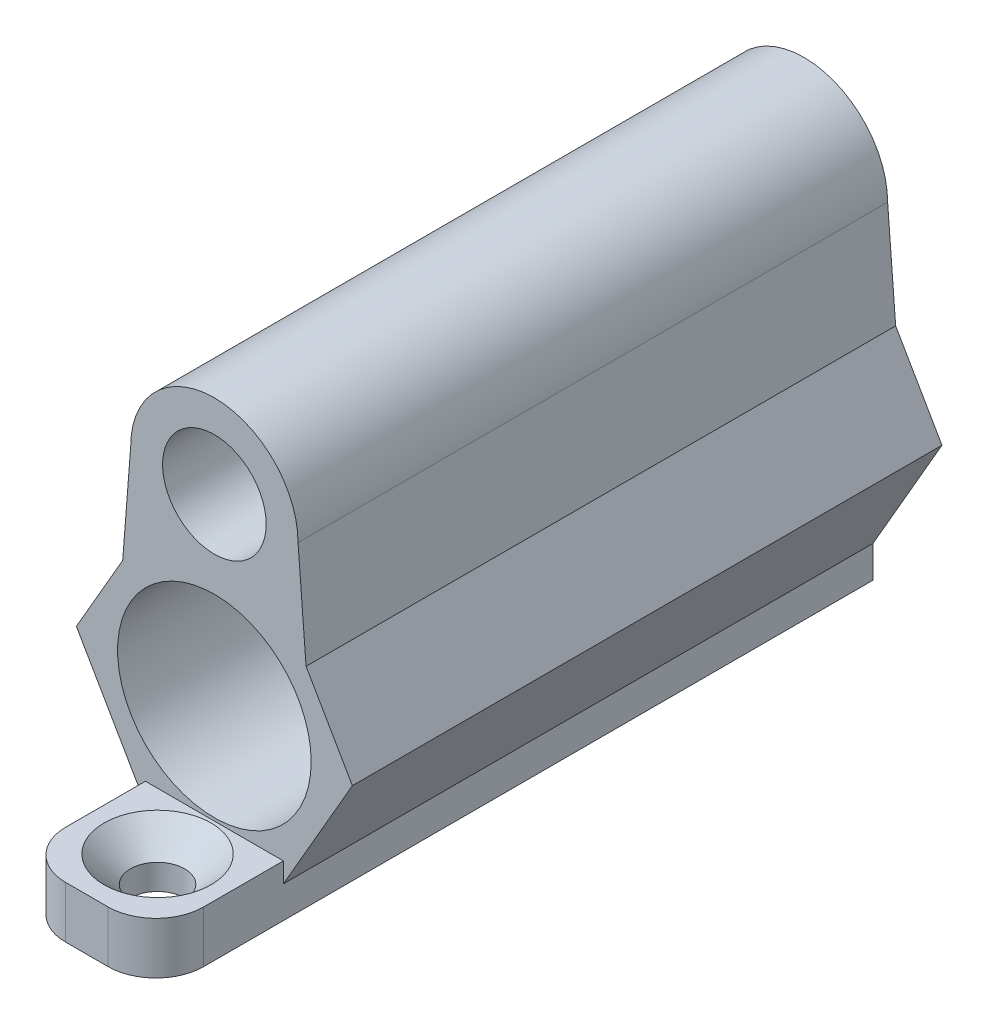
ISO-10303-21;
HEADER;
FILE_DESCRIPTION(('STEP AP214'),'2;1');
FILE_NAME('part.step','',(''),(''),'','','');
FILE_SCHEMA(('AUTOMOTIVE_DESIGN { 1 0 10303 214 1 1 1 1 }'));
ENDSEC;
DATA;
#1=APPLICATION_CONTEXT('core data for automotive mechanical design processes');
#2=APPLICATION_PROTOCOL_DEFINITION('international standard','automotive_design',2000,#1);
#3=PRODUCT_CONTEXT('',#1,'mechanical');
#4=PRODUCT('Part','Part','',(#3));
#5=PRODUCT_RELATED_PRODUCT_CATEGORY('part','',(#4));
#6=PRODUCT_DEFINITION_FORMATION('','',#4);
#7=PRODUCT_DEFINITION_CONTEXT('part definition',#1,'design');
#8=PRODUCT_DEFINITION('design','',#6,#7);
#9=PRODUCT_DEFINITION_SHAPE('','',#8);
#10=(LENGTH_UNIT() NAMED_UNIT(*) SI_UNIT(.MILLI.,.METRE.));
#11=(NAMED_UNIT(*) PLANE_ANGLE_UNIT() SI_UNIT($,.RADIAN.));
#12=(NAMED_UNIT(*) SI_UNIT($,.STERADIAN.) SOLID_ANGLE_UNIT());
#13=UNCERTAINTY_MEASURE_WITH_UNIT(LENGTH_MEASURE(1.E-05),#10,'distance_accuracy_value','');
#14=(GEOMETRIC_REPRESENTATION_CONTEXT(3) GLOBAL_UNCERTAINTY_ASSIGNED_CONTEXT((#13)) GLOBAL_UNIT_ASSIGNED_CONTEXT((#10,
#11,#12)) REPRESENTATION_CONTEXT('',''));
#15=CARTESIAN_POINT('',(0.,0.,0.));
#16=DIRECTION('',(0.,0.,1.));
#17=DIRECTION('',(1.,0.,0.));
#18=AXIS2_PLACEMENT_3D('',#15,#16,#17);
#19=CARTESIAN_POINT('',(3.24759526419165,1.875,37.));
#20=DIRECTION('',(-0.866025403784438,-0.5,0.));
#21=DIRECTION('',(0.5,-0.866025403784439,0.));
#22=AXIS2_PLACEMENT_3D('',#19,#20,#21);
#23=PLANE('',#22);
#24=DIRECTION('',(0.,0.,1.));
#25=VECTOR('',#24,1.);
#26=CARTESIAN_POINT('',(5.75349685702698,-2.46534887755855,0.));
#27=LINE('',#26,#25);
#28=CARTESIAN_POINT('',(5.75349685702698,-2.46534887755856,0.));
#29=VERTEX_POINT('',#28);
#30=CARTESIAN_POINT('',(5.75349685702698,-2.46534887755856,37.));
#31=VERTEX_POINT('',#30);
#32=EDGE_CURVE('E316',#29,#31,#27,.T.);
#33=ORIENTED_EDGE('',*,*,#32,.T.);
#34=DIRECTION('',(-0.5,0.866025403784439,0.));
#35=VECTOR('',#34,1.);
#36=CARTESIAN_POINT('',(3.24759526419165,1.875,37.));
#37=LINE('',#36,#35);
#38=CARTESIAN_POINT('',(8.66025403784439,-7.49999999999999,37.));
#39=VERTEX_POINT('',#38);
#40=EDGE_CURVE('E175',#39,#31,#37,.T.);
#41=ORIENTED_EDGE('',*,*,#40,.F.);
#42=DIRECTION('',(0.,0.,-1.));
#43=VECTOR('',#42,1.);
#44=CARTESIAN_POINT('',(8.66025403784439,-7.49999999999999,37.));
#45=LINE('',#44,#43);
#46=CARTESIAN_POINT('',(8.66025403784439,-7.49999999999999,0.));
#47=VERTEX_POINT('',#46);
#48=EDGE_CURVE('E167',#39,#47,#45,.T.);
#49=ORIENTED_EDGE('',*,*,#48,.T.);
#50=DIRECTION('',(-0.5,0.866025403784439,0.));
#51=VECTOR('',#50,1.);
#52=CARTESIAN_POINT('',(3.24759526419165,1.875,0.));
#53=LINE('',#52,#51);
#54=EDGE_CURVE('E251',#47,#29,#53,.T.);
#55=ORIENTED_EDGE('',*,*,#54,.T.);
#56=EDGE_LOOP('',(#33,#41,#49,#55));
#57=FACE_BOUND('',#56,.T.);
#58=ADVANCED_FACE('F35',(#57),#23,.F.);
#59=CARTESIAN_POINT('',(0.,-7.5,37.));
#60=DIRECTION('',(0.,0.,-1.));
#61=DIRECTION('',(-1.,0.,0.));
#62=AXIS2_PLACEMENT_3D('',#59,#60,#61);
#63=CYLINDRICAL_SURFACE('',#62,2.44);
#64=CARTESIAN_POINT('',(0.,-7.5,0.));
#65=DIRECTION('',(0.,0.,1.));
#66=DIRECTION('',(1.,0.,0.));
#67=AXIS2_PLACEMENT_3D('',#64,#65,#66);
#68=CIRCLE('',#67,2.44);
#69=CARTESIAN_POINT('',(2.44000000000001,-7.5,0.));
#70=VERTEX_POINT('',#69);
#71=EDGE_CURVE('E252',#70,#70,#68,.T.);
#72=ORIENTED_EDGE('',*,*,#71,.F.);
#73=EDGE_LOOP('',(#72));
#74=FACE_BOUND('',#73,.T.);
#75=CARTESIAN_POINT('',(0.,-7.5,4.));
#76=DIRECTION('',(0.,0.,1.));
#77=DIRECTION('',(1.,0.,0.));
#78=AXIS2_PLACEMENT_3D('',#75,#76,#77);
#79=CIRCLE('',#78,2.44);
#80=CARTESIAN_POINT('',(2.44000000000001,-7.5,4.));
#81=VERTEX_POINT('',#80);
#82=EDGE_CURVE('E278',#81,#81,#79,.T.);
#83=ORIENTED_EDGE('',*,*,#82,.T.);
#84=EDGE_LOOP('',(#83));
#85=FACE_BOUND('',#84,.T.);
#86=ADVANCED_FACE('F221',(#74,#85),#63,.F.);
#87=CARTESIAN_POINT('',(0.,4.,37.));
#88=DIRECTION('',(0.,0.,-1.));
#89=DIRECTION('',(-1.,0.,0.));
#90=AXIS2_PLACEMENT_3D('',#87,#88,#89);
#91=CYLINDRICAL_SURFACE('',#90,2.44);
#92=CARTESIAN_POINT('',(0.,4.,0.));
#93=DIRECTION('',(0.,0.,1.));
#94=DIRECTION('',(1.,0.,0.));
#95=AXIS2_PLACEMENT_3D('',#92,#93,#94);
#96=CIRCLE('',#95,2.44);
#97=CARTESIAN_POINT('',(2.44,4.,0.));
#98=VERTEX_POINT('',#97);
#99=EDGE_CURVE('E176',#98,#98,#96,.T.);
#100=ORIENTED_EDGE('',*,*,#99,.F.);
#101=EDGE_LOOP('',(#100));
#102=FACE_BOUND('',#101,.T.);
#103=CARTESIAN_POINT('',(0.,4.,4.));
#104=DIRECTION('',(0.,0.,1.));
#105=DIRECTION('',(1.,0.,0.));
#106=AXIS2_PLACEMENT_3D('',#103,#104,#105);
#107=CIRCLE('',#106,2.44);
#108=CARTESIAN_POINT('',(2.44,4.,4.));
#109=VERTEX_POINT('',#108);
#110=EDGE_CURVE('E274',#109,#109,#107,.T.);
#111=ORIENTED_EDGE('',*,*,#110,.T.);
#112=EDGE_LOOP('',(#111));
#113=FACE_BOUND('',#112,.T.);
#114=ADVANCED_FACE('F227',(#102,#113),#91,.F.);
#115=CARTESIAN_POINT('',(9.74278579257493,-5.62499999999999,37.));
#116=DIRECTION('',(-0.866025403784439,0.5,0.));
#117=DIRECTION('',(-0.5,-0.866025403784439,0.));
#118=AXIS2_PLACEMENT_3D('',#115,#116,#117);
#119=PLANE('',#118);
#120=DIRECTION('',(0.5,0.866025403784439,0.));
#121=VECTOR('',#120,1.);
#122=CARTESIAN_POINT('',(9.74278579257493,-5.62499999999999,0.));
#123=LINE('',#122,#121);
#124=CARTESIAN_POINT('',(4.33012701892219,-15.,0.));
#125=VERTEX_POINT('',#124);
#126=EDGE_CURVE('E245',#125,#47,#123,.T.);
#127=ORIENTED_EDGE('',*,*,#126,.T.);
#128=ORIENTED_EDGE('',*,*,#48,.F.);
#129=DIRECTION('',(0.5,0.866025403784439,0.));
#130=VECTOR('',#129,1.);
#131=CARTESIAN_POINT('',(9.74278579257493,-5.62499999999999,37.));
#132=LINE('',#131,#130);
#133=CARTESIAN_POINT('',(4.33012701892219,-15.,37.));
#134=VERTEX_POINT('',#133);
#135=EDGE_CURVE('E173',#134,#39,#132,.T.);
#136=ORIENTED_EDGE('',*,*,#135,.F.);
#137=DIRECTION('',(0.,0.,-1.));
#138=VECTOR('',#137,1.);
#139=CARTESIAN_POINT('',(4.33012701892219,-15.,37.));
#140=LINE('',#139,#138);
#141=EDGE_CURVE('E161',#134,#125,#140,.T.);
#142=ORIENTED_EDGE('',*,*,#141,.T.);
#143=EDGE_LOOP('',(#127,#128,#136,#142));
#144=FACE_BOUND('',#143,.T.);
#145=ADVANCED_FACE('F233',(#144),#119,.F.);
#146=CARTESIAN_POINT('',(-3.24759526419163,1.87499999999999,37.));
#147=DIRECTION('',(0.866025403784439,-0.5,0.));
#148=DIRECTION('',(0.5,0.866025403784439,0.));
#149=AXIS2_PLACEMENT_3D('',#146,#147,#148);
#150=PLANE('',#149);
#151=DIRECTION('',(-0.5,-0.866025403784439,0.));
#152=VECTOR('',#151,1.);
#153=CARTESIAN_POINT('',(-3.24759526419163,1.87499999999999,37.));
#154=LINE('',#153,#152);
#155=CARTESIAN_POINT('',(-5.75349685702695,-2.46534887755856,37.));
#156=VERTEX_POINT('',#155);
#157=CARTESIAN_POINT('',(-8.66025403784437,-7.50000000000001,37.));
#158=VERTEX_POINT('',#157);
#159=EDGE_CURVE('E184',#156,#158,#154,.T.);
#160=ORIENTED_EDGE('',*,*,#159,.F.);
#161=DIRECTION('',(0.,0.,1.));
#162=VECTOR('',#161,1.);
#163=CARTESIAN_POINT('',(-5.75349685702695,-2.46534887755856,0.));
#164=LINE('',#163,#162);
#165=CARTESIAN_POINT('',(-5.75349685702695,-2.46534887755856,0.));
#166=VERTEX_POINT('',#165);
#167=EDGE_CURVE('E318',#166,#156,#164,.T.);
#168=ORIENTED_EDGE('',*,*,#167,.F.);
#169=DIRECTION('',(-0.5,-0.866025403784439,0.));
#170=VECTOR('',#169,1.);
#171=CARTESIAN_POINT('',(-3.24759526419163,1.87499999999999,0.));
#172=LINE('',#171,#170);
#173=CARTESIAN_POINT('',(-8.66025403784437,-7.50000000000001,0.));
#174=VERTEX_POINT('',#173);
#175=EDGE_CURVE('E263',#166,#174,#172,.T.);
#176=ORIENTED_EDGE('',*,*,#175,.T.);
#177=DIRECTION('',(0.,0.,-1.));
#178=VECTOR('',#177,1.);
#179=CARTESIAN_POINT('',(-8.66025403784437,-7.50000000000001,37.));
#180=LINE('',#179,#178);
#181=EDGE_CURVE('E189',#158,#174,#180,.T.);
#182=ORIENTED_EDGE('',*,*,#181,.F.);
#183=EDGE_LOOP('',(#160,#168,#176,#182));
#184=FACE_BOUND('',#183,.T.);
#185=ADVANCED_FACE('F231',(#184),#150,.F.);
#186=CARTESIAN_POINT('',(-9.74278579257492,-5.625,37.));
#187=DIRECTION('',(0.866025403784438,0.500000000000001,0.));
#188=DIRECTION('',(-0.500000000000001,0.866025403784438,0.));
#189=AXIS2_PLACEMENT_3D('',#186,#187,#188);
#190=PLANE('',#189);
#191=DIRECTION('',(0.500000000000001,-0.866025403784438,0.));
#192=VECTOR('',#191,1.);
#193=CARTESIAN_POINT('',(-9.74278579257492,-5.625,0.));
#194=LINE('',#193,#192);
#195=CARTESIAN_POINT('',(-4.33012701892216,-15.,0.));
#196=VERTEX_POINT('',#195);
#197=EDGE_CURVE('E265',#174,#196,#194,.T.);
#198=ORIENTED_EDGE('',*,*,#197,.T.);
#199=DIRECTION('',(0.,0.,-1.));
#200=VECTOR('',#199,1.);
#201=CARTESIAN_POINT('',(-4.33012701892216,-15.,37.));
#202=LINE('',#201,#200);
#203=CARTESIAN_POINT('',(-4.33012701892216,-15.,37.));
#204=VERTEX_POINT('',#203);
#205=EDGE_CURVE('E183',#204,#196,#202,.T.);
#206=ORIENTED_EDGE('',*,*,#205,.F.);
#207=DIRECTION('',(0.500000000000001,-0.866025403784438,0.));
#208=VECTOR('',#207,1.);
#209=CARTESIAN_POINT('',(-9.74278579257492,-5.625,37.));
#210=LINE('',#209,#208);
#211=EDGE_CURVE('E181',#158,#204,#210,.T.);
#212=ORIENTED_EDGE('',*,*,#211,.F.);
#213=ORIENTED_EDGE('',*,*,#181,.T.);
#214=EDGE_LOOP('',(#198,#206,#212,#213));
#215=FACE_BOUND('',#214,.T.);
#216=ADVANCED_FACE('F240',(#215),#190,.F.);
#217=CARTESIAN_POINT('',(0.,0.,37.));
#218=DIRECTION('',(0.,0.,1.));
#219=DIRECTION('',(1.,0.,0.));
#220=AXIS2_PLACEMENT_3D('',#217,#218,#219);
#221=PLANE('',#220);
#222=DIRECTION('',(0.,-1.,0.));
#223=VECTOR('',#222,1.);
#224=CARTESIAN_POINT('',(-4.33012701892216,-13.754091294147,37.));
#225=LINE('',#224,#223);
#226=CARTESIAN_POINT('',(-4.33012701892216,-13.754091294147,37.));
#227=VERTEX_POINT('',#226);
#228=EDGE_CURVE('E154',#227,#204,#225,.T.);
#229=ORIENTED_EDGE('',*,*,#228,.F.);
#230=DIRECTION('',(-1.,0.,0.));
#231=VECTOR('',#230,1.);
#232=CARTESIAN_POINT('',(-4.33012701892216,-13.754091294147,37.));
#233=LINE('',#232,#231);
#234=CARTESIAN_POINT('',(4.33012701892219,-13.754091294147,37.));
#235=VERTEX_POINT('',#234);
#236=EDGE_CURVE('E141',#235,#227,#233,.T.);
#237=ORIENTED_EDGE('',*,*,#236,.F.);
#238=DIRECTION('',(0.,1.,0.));
#239=VECTOR('',#238,1.);
#240=CARTESIAN_POINT('',(4.33012701892219,-13.754091294147,37.));
#241=LINE('',#240,#239);
#242=EDGE_CURVE('E151',#134,#235,#241,.T.);
#243=ORIENTED_EDGE('',*,*,#242,.F.);
#244=ORIENTED_EDGE('',*,*,#135,.T.);
#245=ORIENTED_EDGE('',*,*,#40,.T.);
#246=DIRECTION('',(0.0776411291267554,-0.996981371474875,0.));
#247=VECTOR('',#246,1.);
#248=CARTESIAN_POINT('',(5.5279792767052,0.430498066576475,37.));
#249=LINE('',#248,#247);
#250=CARTESIAN_POINT('',(5.25,4.,37.));
#251=VERTEX_POINT('',#250);
#252=EDGE_CURVE('E301',#251,#31,#249,.T.);
#253=ORIENTED_EDGE('',*,*,#252,.F.);
#254=CARTESIAN_POINT('',(0.,4.,37.));
#255=DIRECTION('',(0.,0.,1.));
#256=DIRECTION('',(1.,0.,0.));
#257=AXIS2_PLACEMENT_3D('',#254,#255,#256);
#258=CIRCLE('',#257,5.25);
#259=CARTESIAN_POINT('',(-5.25,4.,37.));
#260=VERTEX_POINT('',#259);
#261=EDGE_CURVE('E296',#251,#260,#258,.T.);
#262=ORIENTED_EDGE('',*,*,#261,.T.);
#263=DIRECTION('',(-0.0776411291267501,-0.996981371474875,0.));
#264=VECTOR('',#263,1.);
#265=CARTESIAN_POINT('',(-5.52797927670518,0.430498066576444,37.));
#266=LINE('',#265,#264);
#267=EDGE_CURVE('E308',#260,#156,#266,.T.);
#268=ORIENTED_EDGE('',*,*,#267,.T.);
#269=ORIENTED_EDGE('',*,*,#159,.T.);
#270=ORIENTED_EDGE('',*,*,#211,.T.);
#271=EDGE_LOOP('',(#229,#237,#243,#244,#245,#253,#262,#268,#269,#270));
#272=FACE_BOUND('',#271,.T.);
#273=CARTESIAN_POINT('',(0.,-7.5,37.));
#274=DIRECTION('',(0.,0.,1.));
#275=DIRECTION('',(1.,0.,0.));
#276=AXIS2_PLACEMENT_3D('',#273,#274,#275);
#277=CIRCLE('',#276,6.075);
#278=CARTESIAN_POINT('',(6.07500000000001,-7.5,37.));
#279=VERTEX_POINT('',#278);
#280=EDGE_CURVE('E315',#279,#279,#277,.T.);
#281=ORIENTED_EDGE('',*,*,#280,.F.);
#282=EDGE_LOOP('',(#281));
#283=FACE_BOUND('',#282,.T.);
#284=CARTESIAN_POINT('',(0.,4.,37.));
#285=DIRECTION('',(0.,0.,1.));
#286=DIRECTION('',(1.,0.,0.));
#287=AXIS2_PLACEMENT_3D('',#284,#285,#286);
#288=CIRCLE('',#287,3.25);
#289=CARTESIAN_POINT('',(3.25,4.,37.));
#290=VERTEX_POINT('',#289);
#291=EDGE_CURVE('E280',#290,#290,#288,.T.);
#292=ORIENTED_EDGE('',*,*,#291,.F.);
#293=EDGE_LOOP('',(#292));
#294=FACE_BOUND('',#293,.T.);
#295=ADVANCED_FACE('F149',(#272,#283,#294),#221,.T.);
#296=CARTESIAN_POINT('',(0.,0.,0.));
#297=DIRECTION('',(0.,0.,1.));
#298=DIRECTION('',(1.,0.,0.));
#299=AXIS2_PLACEMENT_3D('',#296,#297,#298);
#300=PLANE('',#299);
#301=DIRECTION('',(0.0776411291267554,-0.996981371474875,0.));
#302=VECTOR('',#301,1.);
#303=CARTESIAN_POINT('',(5.5279792767052,0.430498066576475,0.));
#304=LINE('',#303,#302);
#305=CARTESIAN_POINT('',(5.25,4.,0.));
#306=VERTEX_POINT('',#305);
#307=EDGE_CURVE('E261',#306,#29,#304,.T.);
#308=ORIENTED_EDGE('',*,*,#307,.T.);
#309=ORIENTED_EDGE('',*,*,#54,.F.);
#310=ORIENTED_EDGE('',*,*,#126,.F.);
#311=DIRECTION('',(0.,1.,0.));
#312=VECTOR('',#311,1.);
#313=CARTESIAN_POINT('',(4.33012701892219,-17.,0.));
#314=LINE('',#313,#312);
#315=CARTESIAN_POINT('',(4.33012701892219,-17.,0.));
#316=VERTEX_POINT('',#315);
#317=EDGE_CURVE('E291',#316,#125,#314,.T.);
#318=ORIENTED_EDGE('',*,*,#317,.F.);
#319=DIRECTION('',(1.,0.,0.));
#320=VECTOR('',#319,1.);
#321=CARTESIAN_POINT('',(-4.33012701892216,-17.,0.));
#322=LINE('',#321,#320);
#323=CARTESIAN_POINT('',(-4.33012701892216,-17.,0.));
#324=VERTEX_POINT('',#323);
#325=EDGE_CURVE('E288',#324,#316,#322,.T.);
#326=ORIENTED_EDGE('',*,*,#325,.F.);
#327=DIRECTION('',(0.,1.,0.));
#328=VECTOR('',#327,1.);
#329=CARTESIAN_POINT('',(-4.33012701892216,-17.,0.));
#330=LINE('',#329,#328);
#331=EDGE_CURVE('E293',#324,#196,#330,.T.);
#332=ORIENTED_EDGE('',*,*,#331,.T.);
#333=ORIENTED_EDGE('',*,*,#197,.F.);
#334=ORIENTED_EDGE('',*,*,#175,.F.);
#335=DIRECTION('',(-0.0776411291267501,-0.996981371474875,0.));
#336=VECTOR('',#335,1.);
#337=CARTESIAN_POINT('',(-5.52797927670518,0.430498066576444,0.));
#338=LINE('',#337,#336);
#339=CARTESIAN_POINT('',(-5.25,4.,0.));
#340=VERTEX_POINT('',#339);
#341=EDGE_CURVE('E300',#340,#166,#338,.T.);
#342=ORIENTED_EDGE('',*,*,#341,.F.);
#343=CARTESIAN_POINT('',(0.,4.,0.));
#344=DIRECTION('',(0.,0.,1.));
#345=DIRECTION('',(1.,0.,0.));
#346=AXIS2_PLACEMENT_3D('',#343,#344,#345);
#347=CIRCLE('',#346,5.25);
#348=EDGE_CURVE('E297',#306,#340,#347,.T.);
#349=ORIENTED_EDGE('',*,*,#348,.F.);
#350=EDGE_LOOP('',(#308,#309,#310,#318,#326,#332,#333,#334,#342,#349));
#351=FACE_BOUND('',#350,.T.);
#352=ORIENTED_EDGE('',*,*,#71,.T.);
#353=EDGE_LOOP('',(#352));
#354=FACE_BOUND('',#353,.T.);
#355=ORIENTED_EDGE('',*,*,#99,.T.);
#356=EDGE_LOOP('',(#355));
#357=FACE_BOUND('',#356,.T.);
#358=ADVANCED_FACE('F257',(#351,#354,#357),#300,.F.);
#359=CARTESIAN_POINT('',(0.,4.,4.));
#360=DIRECTION('',(0.,0.,1.));
#361=DIRECTION('',(1.,0.,0.));
#362=AXIS2_PLACEMENT_3D('',#359,#360,#361);
#363=CYLINDRICAL_SURFACE('',#362,3.25);
#364=CARTESIAN_POINT('',(0.,4.,4.));
#365=DIRECTION('',(0.,0.,1.));
#366=DIRECTION('',(1.,0.,0.));
#367=AXIS2_PLACEMENT_3D('',#364,#365,#366);
#368=CIRCLE('',#367,3.25);
#369=CARTESIAN_POINT('',(3.25,4.,4.));
#370=VERTEX_POINT('',#369);
#371=EDGE_CURVE('E277',#370,#370,#368,.T.);
#372=ORIENTED_EDGE('',*,*,#371,.F.);
#373=EDGE_LOOP('',(#372));
#374=FACE_BOUND('',#373,.T.);
#375=ORIENTED_EDGE('',*,*,#291,.T.);
#376=EDGE_LOOP('',(#375));
#377=FACE_BOUND('',#376,.T.);
#378=ADVANCED_FACE('F355',(#374,#377),#363,.F.);
#379=CARTESIAN_POINT('',(0.,4.,4.));
#380=DIRECTION('',(0.,0.,1.));
#381=DIRECTION('',(1.,0.,0.));
#382=AXIS2_PLACEMENT_3D('',#379,#380,#381);
#383=PLANE('',#382);
#384=ORIENTED_EDGE('',*,*,#110,.F.);
#385=EDGE_LOOP('',(#384));
#386=FACE_BOUND('',#385,.T.);
#387=ORIENTED_EDGE('',*,*,#371,.T.);
#388=EDGE_LOOP('',(#387));
#389=FACE_BOUND('',#388,.T.);
#390=ADVANCED_FACE('F347',(#386,#389),#383,.T.);
#391=CARTESIAN_POINT('',(0.,-7.5,4.));
#392=DIRECTION('',(0.,0.,1.));
#393=DIRECTION('',(1.,0.,0.));
#394=AXIS2_PLACEMENT_3D('',#391,#392,#393);
#395=CYLINDRICAL_SURFACE('',#394,6.075);
#396=CARTESIAN_POINT('',(0.,-7.5,4.));
#397=DIRECTION('',(0.,0.,1.));
#398=DIRECTION('',(1.,0.,0.));
#399=AXIS2_PLACEMENT_3D('',#396,#397,#398);
#400=CIRCLE('',#399,6.075);
#401=CARTESIAN_POINT('',(6.07500000000001,-7.5,4.));
#402=VERTEX_POINT('',#401);
#403=EDGE_CURVE('E281',#402,#402,#400,.T.);
#404=ORIENTED_EDGE('',*,*,#403,.F.);
#405=EDGE_LOOP('',(#404));
#406=FACE_BOUND('',#405,.T.);
#407=ORIENTED_EDGE('',*,*,#280,.T.);
#408=EDGE_LOOP('',(#407));
#409=FACE_BOUND('',#408,.T.);
#410=ADVANCED_FACE('F341',(#406,#409),#395,.F.);
#411=CARTESIAN_POINT('',(0.,-7.5,4.));
#412=DIRECTION('',(0.,0.,1.));
#413=DIRECTION('',(1.,0.,0.));
#414=AXIS2_PLACEMENT_3D('',#411,#412,#413);
#415=PLANE('',#414);
#416=ORIENTED_EDGE('',*,*,#82,.F.);
#417=EDGE_LOOP('',(#416));
#418=FACE_BOUND('',#417,.T.);
#419=ORIENTED_EDGE('',*,*,#403,.T.);
#420=EDGE_LOOP('',(#419));
#421=FACE_BOUND('',#420,.T.);
#422=ADVANCED_FACE('F337',(#418,#421),#415,.T.);
#423=CARTESIAN_POINT('',(0.,4.,0.));
#424=DIRECTION('',(0.,0.,1.));
#425=DIRECTION('',(1.,0.,0.));
#426=AXIS2_PLACEMENT_3D('',#423,#424,#425);
#427=CYLINDRICAL_SURFACE('',#426,5.25);
#428=ORIENTED_EDGE('',*,*,#261,.F.);
#429=DIRECTION('',(0.,0.,1.));
#430=VECTOR('',#429,1.);
#431=CARTESIAN_POINT('',(5.25,4.,0.));
#432=LINE('',#431,#430);
#433=EDGE_CURVE('E313',#306,#251,#432,.T.);
#434=ORIENTED_EDGE('',*,*,#433,.F.);
#435=ORIENTED_EDGE('',*,*,#348,.T.);
#436=DIRECTION('',(0.,0.,1.));
#437=VECTOR('',#436,1.);
#438=CARTESIAN_POINT('',(-5.25,4.,0.));
#439=LINE('',#438,#437);
#440=EDGE_CURVE('E305',#340,#260,#439,.T.);
#441=ORIENTED_EDGE('',*,*,#440,.T.);
#442=EDGE_LOOP('',(#428,#434,#435,#441));
#443=FACE_BOUND('',#442,.T.);
#444=ADVANCED_FACE('F340',(#443),#427,.T.);
#445=CARTESIAN_POINT('',(5.5279792767052,0.430498066576475,0.));
#446=DIRECTION('',(-0.996981371474875,-0.0776411291267554,0.));
#447=DIRECTION('',(0.0776411291267554,-0.996981371474875,0.));
#448=AXIS2_PLACEMENT_3D('',#445,#446,#447);
#449=PLANE('',#448);
#450=ORIENTED_EDGE('',*,*,#252,.T.);
#451=ORIENTED_EDGE('',*,*,#32,.F.);
#452=ORIENTED_EDGE('',*,*,#307,.F.);
#453=ORIENTED_EDGE('',*,*,#433,.T.);
#454=EDGE_LOOP('',(#450,#451,#452,#453));
#455=FACE_BOUND('',#454,.T.);
#456=ADVANCED_FACE('F408',(#455),#449,.F.);
#457=CARTESIAN_POINT('',(-5.52797927670518,0.430498066576444,0.));
#458=DIRECTION('',(-0.996981371474875,0.0776411291267501,0.));
#459=DIRECTION('',(-0.0776411291267501,-0.996981371474875,0.));
#460=AXIS2_PLACEMENT_3D('',#457,#458,#459);
#461=PLANE('',#460);
#462=ORIENTED_EDGE('',*,*,#267,.F.);
#463=ORIENTED_EDGE('',*,*,#440,.F.);
#464=ORIENTED_EDGE('',*,*,#341,.T.);
#465=ORIENTED_EDGE('',*,*,#167,.T.);
#466=EDGE_LOOP('',(#462,#463,#464,#465));
#467=FACE_BOUND('',#466,.T.);
#468=ADVANCED_FACE('F407',(#467),#461,.T.);
#469=CARTESIAN_POINT('',(-4.33012701892216,-17.,37.));
#470=DIRECTION('',(1.,0.,0.));
#471=DIRECTION('',(0.,0.,-1.));
#472=AXIS2_PLACEMENT_3D('',#469,#470,#471);
#473=PLANE('',#472);
#474=DIRECTION('',(0.,0.,-1.));
#475=VECTOR('',#474,1.);
#476=CARTESIAN_POINT('',(-4.33012701892216,-17.,37.));
#477=LINE('',#476,#475);
#478=CARTESIAN_POINT('',(-4.33012701892216,-17.,42.));
#479=VERTEX_POINT('',#478);
#480=EDGE_CURVE('E144',#479,#324,#477,.T.);
#481=ORIENTED_EDGE('',*,*,#480,.F.);
#482=DIRECTION('',(0.,-1.,0.));
#483=VECTOR('',#482,1.);
#484=CARTESIAN_POINT('',(-4.33012701892216,-13.754091294147,42.));
#485=LINE('',#484,#483);
#486=CARTESIAN_POINT('',(-4.33012701892216,-13.754091294147,42.));
#487=VERTEX_POINT('',#486);
#488=EDGE_CURVE('E11',#479,#487,#485,.F.);
#489=ORIENTED_EDGE('',*,*,#488,.T.);
#490=DIRECTION('',(0.,0.,-1.));
#491=VECTOR('',#490,1.);
#492=CARTESIAN_POINT('',(-4.33012701892216,-13.754091294147,45.));
#493=LINE('',#492,#491);
#494=EDGE_CURVE('E145',#487,#227,#493,.T.);
#495=ORIENTED_EDGE('',*,*,#494,.T.);
#496=ORIENTED_EDGE('',*,*,#228,.T.);
#497=ORIENTED_EDGE('',*,*,#205,.T.);
#498=ORIENTED_EDGE('',*,*,#331,.F.);
#499=EDGE_LOOP('',(#481,#489,#495,#496,#497,#498));
#500=FACE_BOUND('',#499,.T.);
#501=ADVANCED_FACE('F378',(#500),#473,.F.);
#502=CARTESIAN_POINT('',(4.33012701892219,-17.,37.));
#503=DIRECTION('',(-1.,0.,0.));
#504=DIRECTION('',(0.,0.,1.));
#505=AXIS2_PLACEMENT_3D('',#502,#503,#504);
#506=PLANE('',#505);
#507=DIRECTION('',(0.,0.,-1.));
#508=VECTOR('',#507,1.);
#509=CARTESIAN_POINT('',(4.33012701892219,-13.754091294147,45.));
#510=LINE('',#509,#508);
#511=CARTESIAN_POINT('',(4.33012701892219,-13.754091294147,42.));
#512=VERTEX_POINT('',#511);
#513=EDGE_CURVE('E136',#512,#235,#510,.T.);
#514=ORIENTED_EDGE('',*,*,#513,.F.);
#515=DIRECTION('',(0.,1.,0.));
#516=VECTOR('',#515,1.);
#517=CARTESIAN_POINT('',(4.33012701892219,-17.,42.));
#518=LINE('',#517,#516);
#519=CARTESIAN_POINT('',(4.33012701892219,-17.,42.));
#520=VERTEX_POINT('',#519);
#521=EDGE_CURVE('E58',#512,#520,#518,.F.);
#522=ORIENTED_EDGE('',*,*,#521,.T.);
#523=DIRECTION('',(0.,0.,1.));
#524=VECTOR('',#523,1.);
#525=CARTESIAN_POINT('',(4.33012701892219,-17.,37.));
#526=LINE('',#525,#524);
#527=EDGE_CURVE('E201',#316,#520,#526,.T.);
#528=ORIENTED_EDGE('',*,*,#527,.F.);
#529=ORIENTED_EDGE('',*,*,#317,.T.);
#530=ORIENTED_EDGE('',*,*,#141,.F.);
#531=ORIENTED_EDGE('',*,*,#242,.T.);
#532=EDGE_LOOP('',(#514,#522,#528,#529,#530,#531));
#533=FACE_BOUND('',#532,.T.);
#534=ADVANCED_FACE('F158',(#533),#506,.F.);
#535=CARTESIAN_POINT('',(0.,-17.,0.));
#536=DIRECTION('',(0.,-1.,0.));
#537=DIRECTION('',(0.,0.,-1.));
#538=AXIS2_PLACEMENT_3D('',#535,#536,#537);
#539=PLANE('',#538);
#540=CARTESIAN_POINT('',(0.,-17.,40.5653601388844));
#541=DIRECTION('',(0.,1.,0.));
#542=DIRECTION('',(0.,0.,1.));
#543=AXIS2_PLACEMENT_3D('',#540,#541,#542);
#544=CIRCLE('',#543,1.7);
#545=CARTESIAN_POINT('',(0.,-17.,42.2653601388844));
#546=VERTEX_POINT('',#545);
#547=EDGE_CURVE('E285',#546,#546,#544,.T.);
#548=ORIENTED_EDGE('',*,*,#547,.T.);
#549=EDGE_LOOP('',(#548));
#550=FACE_BOUND('',#549,.T.);
#551=ORIENTED_EDGE('',*,*,#527,.T.);
#552=CARTESIAN_POINT('',(1.33012701892219,-17.,42.));
#553=DIRECTION('',(0.,-1.,0.));
#554=DIRECTION('',(0.,0.,-1.));
#555=AXIS2_PLACEMENT_3D('',#552,#553,#554);
#556=CIRCLE('',#555,3.);
#557=CARTESIAN_POINT('',(1.33012701892219,-17.,45.));
#558=VERTEX_POINT('',#557);
#559=EDGE_CURVE('E43',#520,#558,#556,.T.);
#560=ORIENTED_EDGE('',*,*,#559,.T.);
#561=DIRECTION('',(1.,0.,0.));
#562=VECTOR('',#561,1.);
#563=CARTESIAN_POINT('',(-4.33012701892216,-17.,45.));
#564=LINE('',#563,#562);
#565=CARTESIAN_POINT('',(-1.33012701892216,-17.,45.));
#566=VERTEX_POINT('',#565);
#567=EDGE_CURVE('E155',#566,#558,#564,.T.);
#568=ORIENTED_EDGE('',*,*,#567,.F.);
#569=CARTESIAN_POINT('',(-1.33012701892216,-17.,42.));
#570=DIRECTION('',(0.,-1.,0.));
#571=DIRECTION('',(0.,0.,-1.));
#572=AXIS2_PLACEMENT_3D('',#569,#570,#571);
#573=CIRCLE('',#572,3.);
#574=EDGE_CURVE('E50',#566,#479,#573,.T.);
#575=ORIENTED_EDGE('',*,*,#574,.T.);
#576=ORIENTED_EDGE('',*,*,#480,.T.);
#577=ORIENTED_EDGE('',*,*,#325,.T.);
#578=EDGE_LOOP('',(#551,#560,#568,#575,#576,#577));
#579=FACE_BOUND('',#578,.T.);
#580=ADVANCED_FACE('F200',(#550,#579),#539,.T.);
#581=CARTESIAN_POINT('',(-4.33012701892216,-13.754091294147,45.));
#582=DIRECTION('',(0.,-1.,0.));
#583=DIRECTION('',(0.,0.,-1.));
#584=AXIS2_PLACEMENT_3D('',#581,#582,#583);
#585=PLANE('',#584);
#586=CARTESIAN_POINT('',(0.,-13.754091294147,40.5653601388844));
#587=DIRECTION('',(0.,1.,0.));
#588=DIRECTION('',(0.,0.,1.));
#589=AXIS2_PLACEMENT_3D('',#586,#587,#588);
#590=CIRCLE('',#589,3.36);
#591=CARTESIAN_POINT('',(0.,-13.754091294147,43.9253601388844));
#592=VERTEX_POINT('',#591);
#593=EDGE_CURVE('E388',#592,#592,#590,.T.);
#594=ORIENTED_EDGE('',*,*,#593,.F.);
#595=EDGE_LOOP('',(#594));
#596=FACE_BOUND('',#595,.T.);
#597=DIRECTION('',(-1.,0.,0.));
#598=VECTOR('',#597,1.);
#599=CARTESIAN_POINT('',(-4.33012701892216,-13.754091294147,45.));
#600=LINE('',#599,#598);
#601=CARTESIAN_POINT('',(1.33012701892219,-13.754091294147,45.));
#602=VERTEX_POINT('',#601);
#603=CARTESIAN_POINT('',(-1.33012701892216,-13.754091294147,45.));
#604=VERTEX_POINT('',#603);
#605=EDGE_CURVE('E208',#602,#604,#600,.T.);
#606=ORIENTED_EDGE('',*,*,#605,.F.);
#607=CARTESIAN_POINT('',(1.33012701892219,-13.754091294147,42.));
#608=DIRECTION('',(0.,-1.,0.));
#609=DIRECTION('',(0.,0.,-1.));
#610=AXIS2_PLACEMENT_3D('',#607,#608,#609);
#611=CIRCLE('',#610,3.);
#612=EDGE_CURVE('E142',#602,#512,#611,.F.);
#613=ORIENTED_EDGE('',*,*,#612,.T.);
#614=ORIENTED_EDGE('',*,*,#513,.T.);
#615=ORIENTED_EDGE('',*,*,#236,.T.);
#616=ORIENTED_EDGE('',*,*,#494,.F.);
#617=CARTESIAN_POINT('',(-1.33012701892216,-13.754091294147,42.));
#618=DIRECTION('',(0.,-1.,0.));
#619=DIRECTION('',(0.,0.,-1.));
#620=AXIS2_PLACEMENT_3D('',#617,#618,#619);
#621=CIRCLE('',#620,3.);
#622=EDGE_CURVE('E194',#487,#604,#621,.F.);
#623=ORIENTED_EDGE('',*,*,#622,.T.);
#624=EDGE_LOOP('',(#606,#613,#614,#615,#616,#623));
#625=FACE_BOUND('',#624,.T.);
#626=ADVANCED_FACE('F139',(#596,#625),#585,.F.);
#627=CARTESIAN_POINT('',(0.,0.,45.));
#628=DIRECTION('',(0.,0.,1.));
#629=DIRECTION('',(1.,0.,0.));
#630=AXIS2_PLACEMENT_3D('',#627,#628,#629);
#631=PLANE('',#630);
#632=ORIENTED_EDGE('',*,*,#567,.T.);
#633=DIRECTION('',(0.,1.,0.));
#634=VECTOR('',#633,1.);
#635=CARTESIAN_POINT('',(1.33012701892219,-13.754091294147,45.));
#636=LINE('',#635,#634);
#637=EDGE_CURVE('E165',#558,#602,#636,.T.);
#638=ORIENTED_EDGE('',*,*,#637,.T.);
#639=ORIENTED_EDGE('',*,*,#605,.T.);
#640=DIRECTION('',(0.,-1.,0.));
#641=VECTOR('',#640,1.);
#642=CARTESIAN_POINT('',(-1.33012701892216,-17.,45.));
#643=LINE('',#642,#641);
#644=EDGE_CURVE('E162',#604,#566,#643,.T.);
#645=ORIENTED_EDGE('',*,*,#644,.T.);
#646=EDGE_LOOP('',(#632,#638,#639,#645));
#647=FACE_BOUND('',#646,.T.);
#648=ADVANCED_FACE('F205',(#647),#631,.T.);
#649=CARTESIAN_POINT('',(1.33012701892219,0.,42.));
#650=DIRECTION('',(0.,-1.,0.));
#651=DIRECTION('',(0.,0.,-1.));
#652=AXIS2_PLACEMENT_3D('',#649,#650,#651);
#653=CYLINDRICAL_SURFACE('',#652,3.);
#654=ORIENTED_EDGE('',*,*,#559,.F.);
#655=ORIENTED_EDGE('',*,*,#521,.F.);
#656=ORIENTED_EDGE('',*,*,#612,.F.);
#657=ORIENTED_EDGE('',*,*,#637,.F.);
#658=EDGE_LOOP('',(#654,#655,#656,#657));
#659=FACE_BOUND('',#658,.T.);
#660=ADVANCED_FACE('F210',(#659),#653,.T.);
#661=CARTESIAN_POINT('',(-1.33012701892216,0.,42.));
#662=DIRECTION('',(0.,1.,0.));
#663=DIRECTION('',(0.,0.,1.));
#664=AXIS2_PLACEMENT_3D('',#661,#662,#663);
#665=CYLINDRICAL_SURFACE('',#664,3.);
#666=ORIENTED_EDGE('',*,*,#622,.F.);
#667=ORIENTED_EDGE('',*,*,#488,.F.);
#668=ORIENTED_EDGE('',*,*,#574,.F.);
#669=ORIENTED_EDGE('',*,*,#644,.F.);
#670=EDGE_LOOP('',(#666,#667,#668,#669));
#671=FACE_BOUND('',#670,.T.);
#672=ADVANCED_FACE('F37',(#671),#665,.T.);
#673=CARTESIAN_POINT('',(0.,-13.754091294147,40.5653601388844));
#674=DIRECTION('',(0.,1.,0.));
#675=DIRECTION('',(0.,0.,1.));
#676=AXIS2_PLACEMENT_3D('',#673,#674,#675);
#677=CYLINDRICAL_SURFACE('',#676,1.7);
#678=ORIENTED_EDGE('',*,*,#547,.F.);
#679=EDGE_LOOP('',(#678));
#680=FACE_BOUND('',#679,.T.);
#681=CARTESIAN_POINT('',(0.,-15.414091294147,40.5653601388844));
#682=DIRECTION('',(0.,1.,0.));
#683=DIRECTION('',(0.,0.,1.));
#684=AXIS2_PLACEMENT_3D('',#681,#682,#683);
#685=CIRCLE('',#684,1.7);
#686=CARTESIAN_POINT('',(0.,-15.414091294147,42.2653601388844));
#687=VERTEX_POINT('',#686);
#688=EDGE_CURVE('E385',#687,#687,#685,.T.);
#689=ORIENTED_EDGE('',*,*,#688,.T.);
#690=EDGE_LOOP('',(#689));
#691=FACE_BOUND('',#690,.T.);
#692=ADVANCED_FACE('F216',(#680,#691),#677,.F.);
#693=CARTESIAN_POINT('',(0.,-13.754091294147,40.5653601388844));
#694=DIRECTION('',(0.,1.,0.));
#695=DIRECTION('',(0.,0.,1.));
#696=AXIS2_PLACEMENT_3D('',#693,#694,#695);
#697=CONICAL_SURFACE('',#696,3.36,0.785398163397448);
#698=ORIENTED_EDGE('',*,*,#688,.F.);
#699=EDGE_LOOP('',(#698));
#700=FACE_BOUND('',#699,.T.);
#701=ORIENTED_EDGE('',*,*,#593,.T.);
#702=EDGE_LOOP('',(#701));
#703=FACE_BOUND('',#702,.T.);
#704=ADVANCED_FACE('F392',(#700,#703),#697,.F.);
#705=CLOSED_SHELL('',(#58,#86,#114,#145,#185,#216,#295,#358,#378,#390,#410,#422,#444,#456,#468,
#501,#534,#580,#626,#648,#660,#672,#692,#704));
#706=MANIFOLD_SOLID_BREP('B2',#705);
#707=ADVANCED_BREP_SHAPE_REPRESENTATION('',(#18,#706),#14);
#708=SHAPE_DEFINITION_REPRESENTATION(#9,#707);
ENDSEC;
END-ISO-10303-21;
